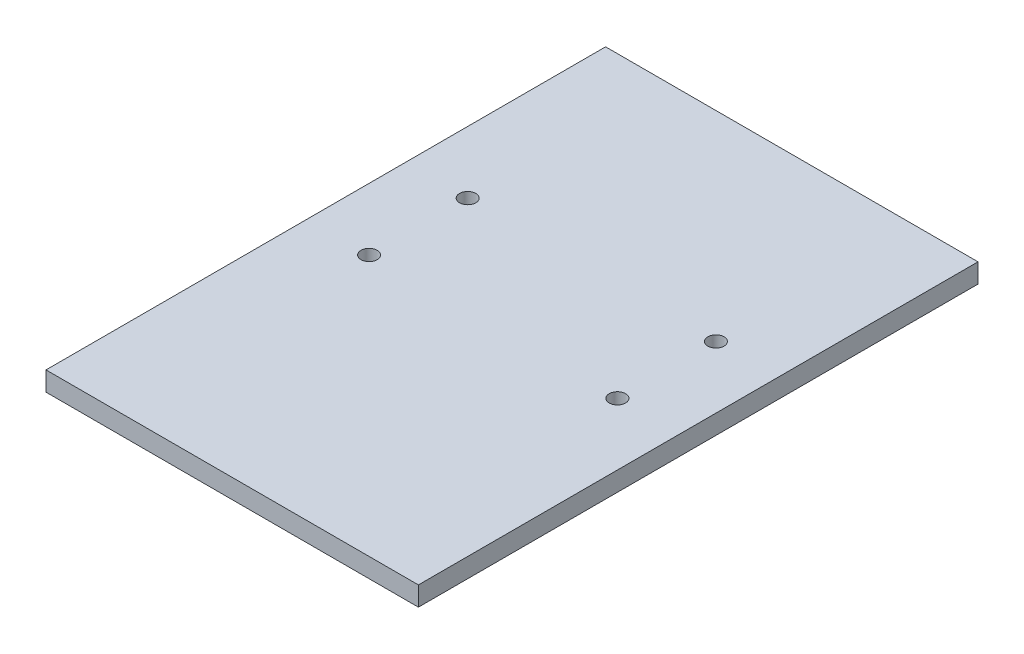
ISO-10303-21;
HEADER;
FILE_DESCRIPTION(('STEP AP214'),'2;1');
FILE_NAME('part.step','',(''),(''),'','','');
FILE_SCHEMA(('AUTOMOTIVE_DESIGN { 1 0 10303 214 1 1 1 1 }'));
ENDSEC;
DATA;
#1=APPLICATION_CONTEXT('core data for automotive mechanical design processes');
#2=APPLICATION_PROTOCOL_DEFINITION('international standard','automotive_design',2000,#1);
#3=PRODUCT_CONTEXT('',#1,'mechanical');
#4=PRODUCT('Part','Part','',(#3));
#5=PRODUCT_RELATED_PRODUCT_CATEGORY('part','',(#4));
#6=PRODUCT_DEFINITION_FORMATION('','',#4);
#7=PRODUCT_DEFINITION_CONTEXT('part definition',#1,'design');
#8=PRODUCT_DEFINITION('design','',#6,#7);
#9=PRODUCT_DEFINITION_SHAPE('','',#8);
#10=(LENGTH_UNIT() NAMED_UNIT(*) SI_UNIT(.MILLI.,.METRE.));
#11=(NAMED_UNIT(*) PLANE_ANGLE_UNIT() SI_UNIT($,.RADIAN.));
#12=(NAMED_UNIT(*) SI_UNIT($,.STERADIAN.) SOLID_ANGLE_UNIT());
#13=UNCERTAINTY_MEASURE_WITH_UNIT(LENGTH_MEASURE(1.E-05),#10,'distance_accuracy_value','');
#14=(GEOMETRIC_REPRESENTATION_CONTEXT(3) GLOBAL_UNCERTAINTY_ASSIGNED_CONTEXT((#13)) GLOBAL_UNIT_ASSIGNED_CONTEXT((#10,
#11,#12)) REPRESENTATION_CONTEXT('',''));
#15=CARTESIAN_POINT('',(0.,0.,0.));
#16=DIRECTION('',(0.,0.,1.));
#17=DIRECTION('',(1.,0.,0.));
#18=AXIS2_PLACEMENT_3D('',#15,#16,#17);
#19=CARTESIAN_POINT('',(120.015,12.446,-180.34));
#20=DIRECTION('',(-1.,0.,0.));
#21=DIRECTION('',(0.,0.,1.));
#22=AXIS2_PLACEMENT_3D('',#19,#20,#21);
#23=PLANE('',#22);
#24=DIRECTION('',(0.,0.,-1.));
#25=VECTOR('',#24,1.);
#26=CARTESIAN_POINT('',(120.015,0.,-180.34));
#27=LINE('',#26,#25);
#28=CARTESIAN_POINT('',(120.015,0.,180.34));
#29=VERTEX_POINT('',#28);
#30=CARTESIAN_POINT('',(120.015,0.,-180.34));
#31=VERTEX_POINT('',#30);
#32=EDGE_CURVE('E114',#29,#31,#27,.T.);
#33=ORIENTED_EDGE('',*,*,#32,.T.);
#34=DIRECTION('',(0.,-1.,0.));
#35=VECTOR('',#34,1.);
#36=CARTESIAN_POINT('',(120.015,12.446,-180.34));
#37=LINE('',#36,#35);
#38=CARTESIAN_POINT('',(120.015,12.446,-180.34));
#39=VERTEX_POINT('',#38);
#40=EDGE_CURVE('E11',#39,#31,#37,.T.);
#41=ORIENTED_EDGE('',*,*,#40,.F.);
#42=DIRECTION('',(0.,0.,-1.));
#43=VECTOR('',#42,1.);
#44=CARTESIAN_POINT('',(120.015,12.446,-180.34));
#45=LINE('',#44,#43);
#46=CARTESIAN_POINT('',(120.015,12.446,180.34));
#47=VERTEX_POINT('',#46);
#48=EDGE_CURVE('E97',#47,#39,#45,.T.);
#49=ORIENTED_EDGE('',*,*,#48,.F.);
#50=DIRECTION('',(0.,-1.,0.));
#51=VECTOR('',#50,1.);
#52=CARTESIAN_POINT('',(120.015,12.446,180.34));
#53=LINE('',#52,#51);
#54=EDGE_CURVE('E110',#47,#29,#53,.T.);
#55=ORIENTED_EDGE('',*,*,#54,.T.);
#56=EDGE_LOOP('',(#33,#41,#49,#55));
#57=FACE_BOUND('',#56,.T.);
#58=ADVANCED_FACE('F43',(#57),#23,.F.);
#59=CARTESIAN_POINT('',(-120.015,12.446,-180.34));
#60=DIRECTION('',(0.,0.,1.));
#61=DIRECTION('',(1.,0.,0.));
#62=AXIS2_PLACEMENT_3D('',#59,#60,#61);
#63=PLANE('',#62);
#64=DIRECTION('',(-1.,0.,0.));
#65=VECTOR('',#64,1.);
#66=CARTESIAN_POINT('',(-120.015,0.,-180.34));
#67=LINE('',#66,#65);
#68=CARTESIAN_POINT('',(-120.015,0.,-180.34));
#69=VERTEX_POINT('',#68);
#70=EDGE_CURVE('E102',#31,#69,#67,.T.);
#71=ORIENTED_EDGE('',*,*,#70,.T.);
#72=DIRECTION('',(0.,-1.,0.));
#73=VECTOR('',#72,1.);
#74=CARTESIAN_POINT('',(-120.015,12.446,-180.34));
#75=LINE('',#74,#73);
#76=CARTESIAN_POINT('',(-120.015,12.446,-180.34));
#77=VERTEX_POINT('',#76);
#78=EDGE_CURVE('E53',#77,#69,#75,.T.);
#79=ORIENTED_EDGE('',*,*,#78,.F.);
#80=DIRECTION('',(-1.,0.,0.));
#81=VECTOR('',#80,1.);
#82=CARTESIAN_POINT('',(-120.015,12.446,-180.34));
#83=LINE('',#82,#81);
#84=EDGE_CURVE('E92',#39,#77,#83,.T.);
#85=ORIENTED_EDGE('',*,*,#84,.F.);
#86=ORIENTED_EDGE('',*,*,#40,.T.);
#87=EDGE_LOOP('',(#71,#79,#85,#86));
#88=FACE_BOUND('',#87,.T.);
#89=ADVANCED_FACE('F101',(#88),#63,.F.);
#90=CARTESIAN_POINT('',(-120.015,12.446,-180.34));
#91=DIRECTION('',(1.,0.,0.));
#92=DIRECTION('',(0.,0.,-1.));
#93=AXIS2_PLACEMENT_3D('',#90,#91,#92);
#94=PLANE('',#93);
#95=DIRECTION('',(0.,0.,1.));
#96=VECTOR('',#95,1.);
#97=CARTESIAN_POINT('',(-120.015,0.,-180.34));
#98=LINE('',#97,#96);
#99=CARTESIAN_POINT('',(-120.015,0.,180.34));
#100=VERTEX_POINT('',#99);
#101=EDGE_CURVE('E79',#69,#100,#98,.T.);
#102=ORIENTED_EDGE('',*,*,#101,.T.);
#103=DIRECTION('',(0.,-1.,0.));
#104=VECTOR('',#103,1.);
#105=CARTESIAN_POINT('',(-120.015,12.446,180.34));
#106=LINE('',#105,#104);
#107=CARTESIAN_POINT('',(-120.015,12.446,180.34));
#108=VERTEX_POINT('',#107);
#109=EDGE_CURVE('E104',#108,#100,#106,.T.);
#110=ORIENTED_EDGE('',*,*,#109,.F.);
#111=DIRECTION('',(0.,0.,1.));
#112=VECTOR('',#111,1.);
#113=CARTESIAN_POINT('',(-120.015,12.446,-180.34));
#114=LINE('',#113,#112);
#115=EDGE_CURVE('E95',#77,#108,#114,.T.);
#116=ORIENTED_EDGE('',*,*,#115,.F.);
#117=ORIENTED_EDGE('',*,*,#78,.T.);
#118=EDGE_LOOP('',(#102,#110,#116,#117));
#119=FACE_BOUND('',#118,.T.);
#120=ADVANCED_FACE('F106',(#119),#94,.F.);
#121=CARTESIAN_POINT('',(-120.015,12.446,180.34));
#122=DIRECTION('',(0.,0.,-1.));
#123=DIRECTION('',(-1.,0.,0.));
#124=AXIS2_PLACEMENT_3D('',#121,#122,#123);
#125=PLANE('',#124);
#126=DIRECTION('',(1.,0.,0.));
#127=VECTOR('',#126,1.);
#128=CARTESIAN_POINT('',(-120.015,0.,180.34));
#129=LINE('',#128,#127);
#130=EDGE_CURVE('E85',#100,#29,#129,.T.);
#131=ORIENTED_EDGE('',*,*,#130,.T.);
#132=ORIENTED_EDGE('',*,*,#54,.F.);
#133=DIRECTION('',(1.,0.,0.));
#134=VECTOR('',#133,1.);
#135=CARTESIAN_POINT('',(-120.015,12.446,180.34));
#136=LINE('',#135,#134);
#137=EDGE_CURVE('E62',#108,#47,#136,.T.);
#138=ORIENTED_EDGE('',*,*,#137,.F.);
#139=ORIENTED_EDGE('',*,*,#109,.T.);
#140=EDGE_LOOP('',(#131,#132,#138,#139));
#141=FACE_BOUND('',#140,.T.);
#142=ADVANCED_FACE('F185',(#141),#125,.F.);
#143=CARTESIAN_POINT('',(0.,12.446,0.));
#144=DIRECTION('',(0.,1.,0.));
#145=DIRECTION('',(0.,0.,1.));
#146=AXIS2_PLACEMENT_3D('',#143,#144,#145);
#147=PLANE('',#146);
#148=CARTESIAN_POINT('',(-80.01,12.446,-51.435));
#149=DIRECTION('',(0.,1.,0.));
#150=DIRECTION('',(0.,0.,1.));
#151=AXIS2_PLACEMENT_3D('',#148,#149,#150);
#152=CIRCLE('',#151,5.24999999999999);
#153=CARTESIAN_POINT('',(-80.01,12.446,-46.185));
#154=VERTEX_POINT('',#153);
#155=EDGE_CURVE('E150',#154,#154,#152,.T.);
#156=ORIENTED_EDGE('',*,*,#155,.F.);
#157=EDGE_LOOP('',(#156));
#158=FACE_BOUND('',#157,.T.);
#159=CARTESIAN_POINT('',(-80.01,12.446,12.065));
#160=DIRECTION('',(0.,1.,0.));
#161=DIRECTION('',(0.,0.,1.));
#162=AXIS2_PLACEMENT_3D('',#159,#160,#161);
#163=CIRCLE('',#162,5.24999999999999);
#164=CARTESIAN_POINT('',(-80.01,12.446,17.315));
#165=VERTEX_POINT('',#164);
#166=EDGE_CURVE('E137',#165,#165,#163,.T.);
#167=ORIENTED_EDGE('',*,*,#166,.F.);
#168=EDGE_LOOP('',(#167));
#169=FACE_BOUND('',#168,.T.);
#170=CARTESIAN_POINT('',(80.01,12.446,-51.435));
#171=DIRECTION('',(0.,1.,0.));
#172=DIRECTION('',(0.,0.,1.));
#173=AXIS2_PLACEMENT_3D('',#170,#171,#172);
#174=CIRCLE('',#173,5.24999999999999);
#175=CARTESIAN_POINT('',(80.01,12.446,-46.185));
#176=VERTEX_POINT('',#175);
#177=EDGE_CURVE('E133',#176,#176,#174,.T.);
#178=ORIENTED_EDGE('',*,*,#177,.F.);
#179=EDGE_LOOP('',(#178));
#180=FACE_BOUND('',#179,.T.);
#181=CARTESIAN_POINT('',(80.01,12.446,12.065));
#182=DIRECTION('',(0.,1.,0.));
#183=DIRECTION('',(0.,0.,1.));
#184=AXIS2_PLACEMENT_3D('',#181,#182,#183);
#185=CIRCLE('',#184,5.24999999999999);
#186=CARTESIAN_POINT('',(80.01,12.446,17.315));
#187=VERTEX_POINT('',#186);
#188=EDGE_CURVE('E132',#187,#187,#185,.T.);
#189=ORIENTED_EDGE('',*,*,#188,.F.);
#190=EDGE_LOOP('',(#189));
#191=FACE_BOUND('',#190,.T.);
#192=ORIENTED_EDGE('',*,*,#48,.T.);
#193=ORIENTED_EDGE('',*,*,#84,.T.);
#194=ORIENTED_EDGE('',*,*,#115,.T.);
#195=ORIENTED_EDGE('',*,*,#137,.T.);
#196=EDGE_LOOP('',(#192,#193,#194,#195));
#197=FACE_BOUND('',#196,.T.);
#198=ADVANCED_FACE('F93',(#158,#169,#180,#191,#197),#147,.T.);
#199=CARTESIAN_POINT('',(0.,0.,0.));
#200=DIRECTION('',(0.,1.,0.));
#201=DIRECTION('',(0.,0.,1.));
#202=AXIS2_PLACEMENT_3D('',#199,#200,#201);
#203=PLANE('',#202);
#204=CARTESIAN_POINT('',(-80.01,0.,-51.435));
#205=DIRECTION('',(0.,1.,0.));
#206=DIRECTION('',(0.,0.,1.));
#207=AXIS2_PLACEMENT_3D('',#204,#205,#206);
#208=CIRCLE('',#207,5.24999999999999);
#209=CARTESIAN_POINT('',(-80.01,0.,-46.185));
#210=VERTEX_POINT('',#209);
#211=EDGE_CURVE('E46',#210,#210,#208,.T.);
#212=ORIENTED_EDGE('',*,*,#211,.T.);
#213=EDGE_LOOP('',(#212));
#214=FACE_BOUND('',#213,.T.);
#215=CARTESIAN_POINT('',(-80.01,0.,12.065));
#216=DIRECTION('',(0.,1.,0.));
#217=DIRECTION('',(0.,0.,1.));
#218=AXIS2_PLACEMENT_3D('',#215,#216,#217);
#219=CIRCLE('',#218,5.24999999999999);
#220=CARTESIAN_POINT('',(-80.01,0.,17.315));
#221=VERTEX_POINT('',#220);
#222=EDGE_CURVE('E134',#221,#221,#219,.T.);
#223=ORIENTED_EDGE('',*,*,#222,.T.);
#224=EDGE_LOOP('',(#223));
#225=FACE_BOUND('',#224,.T.);
#226=CARTESIAN_POINT('',(80.01,0.,-51.435));
#227=DIRECTION('',(0.,1.,0.));
#228=DIRECTION('',(0.,0.,1.));
#229=AXIS2_PLACEMENT_3D('',#226,#227,#228);
#230=CIRCLE('',#229,5.24999999999999);
#231=CARTESIAN_POINT('',(80.01,0.,-46.185));
#232=VERTEX_POINT('',#231);
#233=EDGE_CURVE('E129',#232,#232,#230,.T.);
#234=ORIENTED_EDGE('',*,*,#233,.T.);
#235=EDGE_LOOP('',(#234));
#236=FACE_BOUND('',#235,.T.);
#237=CARTESIAN_POINT('',(80.01,0.,12.065));
#238=DIRECTION('',(0.,1.,0.));
#239=DIRECTION('',(0.,0.,1.));
#240=AXIS2_PLACEMENT_3D('',#237,#238,#239);
#241=CIRCLE('',#240,5.24999999999999);
#242=CARTESIAN_POINT('',(80.01,0.,17.315));
#243=VERTEX_POINT('',#242);
#244=EDGE_CURVE('E118',#243,#243,#241,.T.);
#245=ORIENTED_EDGE('',*,*,#244,.T.);
#246=EDGE_LOOP('',(#245));
#247=FACE_BOUND('',#246,.T.);
#248=ORIENTED_EDGE('',*,*,#32,.F.);
#249=ORIENTED_EDGE('',*,*,#130,.F.);
#250=ORIENTED_EDGE('',*,*,#101,.F.);
#251=ORIENTED_EDGE('',*,*,#70,.F.);
#252=EDGE_LOOP('',(#248,#249,#250,#251));
#253=FACE_BOUND('',#252,.T.);
#254=ADVANCED_FACE('F161',(#214,#225,#236,#247,#253),#203,.F.);
#255=CARTESIAN_POINT('',(80.01,12.446,12.065));
#256=DIRECTION('',(0.,1.,0.));
#257=DIRECTION('',(0.,0.,1.));
#258=AXIS2_PLACEMENT_3D('',#255,#256,#257);
#259=CYLINDRICAL_SURFACE('',#258,5.24999999999999);
#260=ORIENTED_EDGE('',*,*,#188,.T.);
#261=EDGE_LOOP('',(#260));
#262=FACE_BOUND('',#261,.T.);
#263=ORIENTED_EDGE('',*,*,#244,.F.);
#264=EDGE_LOOP('',(#263));
#265=FACE_BOUND('',#264,.T.);
#266=ADVANCED_FACE('F164',(#262,#265),#259,.F.);
#267=CARTESIAN_POINT('',(80.01,12.446,-51.435));
#268=DIRECTION('',(0.,1.,0.));
#269=DIRECTION('',(0.,0.,1.));
#270=AXIS2_PLACEMENT_3D('',#267,#268,#269);
#271=CYLINDRICAL_SURFACE('',#270,5.24999999999999);
#272=ORIENTED_EDGE('',*,*,#177,.T.);
#273=EDGE_LOOP('',(#272));
#274=FACE_BOUND('',#273,.T.);
#275=ORIENTED_EDGE('',*,*,#233,.F.);
#276=EDGE_LOOP('',(#275));
#277=FACE_BOUND('',#276,.T.);
#278=ADVANCED_FACE('F166',(#274,#277),#271,.F.);
#279=CARTESIAN_POINT('',(-80.01,12.446,12.065));
#280=DIRECTION('',(0.,1.,0.));
#281=DIRECTION('',(0.,0.,1.));
#282=AXIS2_PLACEMENT_3D('',#279,#280,#281);
#283=CYLINDRICAL_SURFACE('',#282,5.24999999999999);
#284=ORIENTED_EDGE('',*,*,#166,.T.);
#285=EDGE_LOOP('',(#284));
#286=FACE_BOUND('',#285,.T.);
#287=ORIENTED_EDGE('',*,*,#222,.F.);
#288=EDGE_LOOP('',(#287));
#289=FACE_BOUND('',#288,.T.);
#290=ADVANCED_FACE('F173',(#286,#289),#283,.F.);
#291=CARTESIAN_POINT('',(-80.01,12.446,-51.435));
#292=DIRECTION('',(0.,1.,0.));
#293=DIRECTION('',(0.,0.,1.));
#294=AXIS2_PLACEMENT_3D('',#291,#292,#293);
#295=CYLINDRICAL_SURFACE('',#294,5.24999999999999);
#296=ORIENTED_EDGE('',*,*,#155,.T.);
#297=EDGE_LOOP('',(#296));
#298=FACE_BOUND('',#297,.T.);
#299=ORIENTED_EDGE('',*,*,#211,.F.);
#300=EDGE_LOOP('',(#299));
#301=FACE_BOUND('',#300,.T.);
#302=ADVANCED_FACE('F249',(#298,#301),#295,.F.);
#303=CLOSED_SHELL('',(#58,#89,#120,#142,#198,#254,#266,#278,#290,#302));
#304=MANIFOLD_SOLID_BREP('B2',#303);
#305=ADVANCED_BREP_SHAPE_REPRESENTATION('',(#18,#304),#14);
#306=SHAPE_DEFINITION_REPRESENTATION(#9,#305);
ENDSEC;
END-ISO-10303-21;
